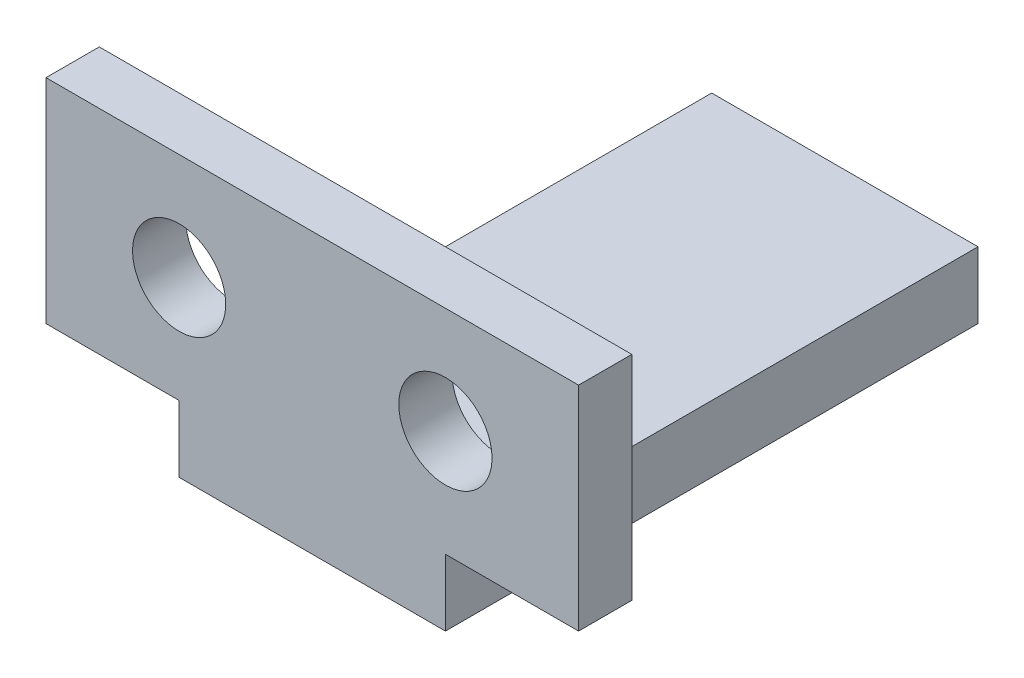
ISO-10303-21;
HEADER;
FILE_DESCRIPTION(('STEP AP214'),'2;1');
FILE_NAME('part.step','',(''),(''),'','','');
FILE_SCHEMA(('AUTOMOTIVE_DESIGN { 1 0 10303 214 1 1 1 1 }'));
ENDSEC;
DATA;
#1=APPLICATION_CONTEXT('core data for automotive mechanical design processes');
#2=APPLICATION_PROTOCOL_DEFINITION('international standard','automotive_design',2000,#1);
#3=PRODUCT_CONTEXT('',#1,'mechanical');
#4=PRODUCT('Part','Part','',(#3));
#5=PRODUCT_RELATED_PRODUCT_CATEGORY('part','',(#4));
#6=PRODUCT_DEFINITION_FORMATION('','',#4);
#7=PRODUCT_DEFINITION_CONTEXT('part definition',#1,'design');
#8=PRODUCT_DEFINITION('design','',#6,#7);
#9=PRODUCT_DEFINITION_SHAPE('','',#8);
#10=(LENGTH_UNIT() NAMED_UNIT(*) SI_UNIT(.MILLI.,.METRE.));
#11=(NAMED_UNIT(*) PLANE_ANGLE_UNIT() SI_UNIT($,.RADIAN.));
#12=(NAMED_UNIT(*) SI_UNIT($,.STERADIAN.) SOLID_ANGLE_UNIT());
#13=UNCERTAINTY_MEASURE_WITH_UNIT(LENGTH_MEASURE(1.E-05),#10,'distance_accuracy_value','');
#14=(GEOMETRIC_REPRESENTATION_CONTEXT(3) GLOBAL_UNCERTAINTY_ASSIGNED_CONTEXT((#13)) GLOBAL_UNIT_ASSIGNED_CONTEXT((#10,
#11,#12)) REPRESENTATION_CONTEXT('',''));
#15=CARTESIAN_POINT('',(0.,0.,0.));
#16=DIRECTION('',(0.,0.,1.));
#17=DIRECTION('',(1.,0.,0.));
#18=AXIS2_PLACEMENT_3D('',#15,#16,#17);
#19=CARTESIAN_POINT('',(0.,0.,2.));
#20=DIRECTION('',(0.,1.,0.));
#21=DIRECTION('',(0.,0.,1.));
#22=AXIS2_PLACEMENT_3D('',#19,#20,#21);
#23=PLANE('',#22);
#24=DIRECTION('',(0.,0.,1.));
#25=VECTOR('',#24,1.);
#26=CARTESIAN_POINT('',(15.,0.,-18.));
#27=LINE('',#26,#25);
#28=CARTESIAN_POINT('',(15.,0.,0.));
#29=VERTEX_POINT('',#28);
#30=CARTESIAN_POINT('',(15.,0.,2.));
#31=VERTEX_POINT('',#30);
#32=EDGE_CURVE('E11',#29,#31,#27,.T.);
#33=ORIENTED_EDGE('',*,*,#32,.F.);
#34=DIRECTION('',(1.,0.,0.));
#35=VECTOR('',#34,1.);
#36=CARTESIAN_POINT('',(0.,0.,0.));
#37=LINE('',#36,#35);
#38=CARTESIAN_POINT('',(20.,0.,0.));
#39=VERTEX_POINT('',#38);
#40=EDGE_CURVE('E167',#29,#39,#37,.T.);
#41=ORIENTED_EDGE('',*,*,#40,.T.);
#42=DIRECTION('',(0.,0.,-1.));
#43=VECTOR('',#42,1.);
#44=CARTESIAN_POINT('',(20.,0.,2.));
#45=LINE('',#44,#43);
#46=CARTESIAN_POINT('',(20.,0.,2.));
#47=VERTEX_POINT('',#46);
#48=EDGE_CURVE('E177',#47,#39,#45,.T.);
#49=ORIENTED_EDGE('',*,*,#48,.F.);
#50=DIRECTION('',(1.,0.,0.));
#51=VECTOR('',#50,1.);
#52=CARTESIAN_POINT('',(0.,0.,2.));
#53=LINE('',#52,#51);
#54=EDGE_CURVE('E159',#31,#47,#53,.T.);
#55=ORIENTED_EDGE('',*,*,#54,.F.);
#56=EDGE_LOOP('',(#33,#41,#49,#55));
#57=FACE_BOUND('',#56,.T.);
#58=ADVANCED_FACE('F35',(#57),#23,.F.);
#59=CARTESIAN_POINT('',(0.,0.,2.));
#60=DIRECTION('',(1.,0.,0.));
#61=DIRECTION('',(0.,0.,-1.));
#62=AXIS2_PLACEMENT_3D('',#59,#60,#61);
#63=PLANE('',#62);
#64=DIRECTION('',(0.,-1.,0.));
#65=VECTOR('',#64,1.);
#66=CARTESIAN_POINT('',(0.,0.,0.));
#67=LINE('',#66,#65);
#68=CARTESIAN_POINT('',(0.,8.,0.));
#69=VERTEX_POINT('',#68);
#70=CARTESIAN_POINT('',(0.,0.,0.));
#71=VERTEX_POINT('',#70);
#72=EDGE_CURVE('E153',#69,#71,#67,.T.);
#73=ORIENTED_EDGE('',*,*,#72,.T.);
#74=DIRECTION('',(0.,0.,-1.));
#75=VECTOR('',#74,1.);
#76=CARTESIAN_POINT('',(0.,0.,2.));
#77=LINE('',#76,#75);
#78=CARTESIAN_POINT('',(0.,0.,2.));
#79=VERTEX_POINT('',#78);
#80=EDGE_CURVE('E39',#79,#71,#77,.T.);
#81=ORIENTED_EDGE('',*,*,#80,.F.);
#82=DIRECTION('',(0.,-1.,0.));
#83=VECTOR('',#82,1.);
#84=CARTESIAN_POINT('',(0.,0.,2.));
#85=LINE('',#84,#83);
#86=CARTESIAN_POINT('',(0.,8.,2.));
#87=VERTEX_POINT('',#86);
#88=EDGE_CURVE('E157',#87,#79,#85,.T.);
#89=ORIENTED_EDGE('',*,*,#88,.F.);
#90=DIRECTION('',(0.,0.,-1.));
#91=VECTOR('',#90,1.);
#92=CARTESIAN_POINT('',(0.,8.,2.));
#93=LINE('',#92,#91);
#94=EDGE_CURVE('E164',#87,#69,#93,.T.);
#95=ORIENTED_EDGE('',*,*,#94,.T.);
#96=EDGE_LOOP('',(#73,#81,#89,#95));
#97=FACE_BOUND('',#96,.T.);
#98=ADVANCED_FACE('F37',(#97),#63,.F.);
#99=CARTESIAN_POINT('',(5.,0.,0.));
#100=VERTEX_POINT('',#99);
#101=EDGE_CURVE('E168',#71,#100,#37,.T.);
#102=ORIENTED_EDGE('',*,*,#101,.T.);
#103=DIRECTION('',(0.,0.,1.));
#104=VECTOR('',#103,1.);
#105=CARTESIAN_POINT('',(5.,0.,-18.));
#106=LINE('',#105,#104);
#107=CARTESIAN_POINT('',(5.,0.,2.));
#108=VERTEX_POINT('',#107);
#109=EDGE_CURVE('E44',#100,#108,#106,.T.);
#110=ORIENTED_EDGE('',*,*,#109,.T.);
#111=EDGE_CURVE('E90',#79,#108,#53,.T.);
#112=ORIENTED_EDGE('',*,*,#111,.F.);
#113=ORIENTED_EDGE('',*,*,#80,.T.);
#114=EDGE_LOOP('',(#102,#110,#112,#113));
#115=FACE_BOUND('',#114,.T.);
#116=ADVANCED_FACE('F184',(#115),#23,.F.);
#117=CARTESIAN_POINT('',(20.,0.,2.));
#118=DIRECTION('',(-1.,0.,0.));
#119=DIRECTION('',(0.,0.,1.));
#120=AXIS2_PLACEMENT_3D('',#117,#118,#119);
#121=PLANE('',#120);
#122=DIRECTION('',(0.,1.,0.));
#123=VECTOR('',#122,1.);
#124=CARTESIAN_POINT('',(20.,0.,0.));
#125=LINE('',#124,#123);
#126=CARTESIAN_POINT('',(20.,8.,0.));
#127=VERTEX_POINT('',#126);
#128=EDGE_CURVE('E171',#39,#127,#125,.T.);
#129=ORIENTED_EDGE('',*,*,#128,.T.);
#130=DIRECTION('',(0.,0.,-1.));
#131=VECTOR('',#130,1.);
#132=CARTESIAN_POINT('',(20.,8.,2.));
#133=LINE('',#132,#131);
#134=CARTESIAN_POINT('',(20.,8.,2.));
#135=VERTEX_POINT('',#134);
#136=EDGE_CURVE('E176',#135,#127,#133,.T.);
#137=ORIENTED_EDGE('',*,*,#136,.F.);
#138=DIRECTION('',(0.,1.,0.));
#139=VECTOR('',#138,1.);
#140=CARTESIAN_POINT('',(20.,0.,2.));
#141=LINE('',#140,#139);
#142=EDGE_CURVE('E161',#47,#135,#141,.T.);
#143=ORIENTED_EDGE('',*,*,#142,.F.);
#144=ORIENTED_EDGE('',*,*,#48,.T.);
#145=EDGE_LOOP('',(#129,#137,#143,#144));
#146=FACE_BOUND('',#145,.T.);
#147=ADVANCED_FACE('F201',(#146),#121,.F.);
#148=CARTESIAN_POINT('',(0.,8.,2.));
#149=DIRECTION('',(0.,-1.,0.));
#150=DIRECTION('',(0.,0.,-1.));
#151=AXIS2_PLACEMENT_3D('',#148,#149,#150);
#152=PLANE('',#151);
#153=DIRECTION('',(-1.,0.,0.));
#154=VECTOR('',#153,1.);
#155=CARTESIAN_POINT('',(0.,8.,0.));
#156=LINE('',#155,#154);
#157=EDGE_CURVE('E83',#127,#69,#156,.T.);
#158=ORIENTED_EDGE('',*,*,#157,.T.);
#159=ORIENTED_EDGE('',*,*,#94,.F.);
#160=DIRECTION('',(-1.,0.,0.));
#161=VECTOR('',#160,1.);
#162=CARTESIAN_POINT('',(0.,8.,2.));
#163=LINE('',#162,#161);
#164=EDGE_CURVE('E62',#135,#87,#163,.T.);
#165=ORIENTED_EDGE('',*,*,#164,.F.);
#166=ORIENTED_EDGE('',*,*,#136,.T.);
#167=EDGE_LOOP('',(#158,#159,#165,#166));
#168=FACE_BOUND('',#167,.T.);
#169=ADVANCED_FACE('F202',(#168),#152,.F.);
#170=CARTESIAN_POINT('',(0.,0.,2.));
#171=DIRECTION('',(0.,0.,-1.));
#172=DIRECTION('',(-1.,0.,0.));
#173=AXIS2_PLACEMENT_3D('',#170,#171,#172);
#174=PLANE('',#173);
#175=CARTESIAN_POINT('',(5.,4.,2.));
#176=DIRECTION('',(0.,0.,-1.));
#177=DIRECTION('',(-1.,0.,0.));
#178=AXIS2_PLACEMENT_3D('',#175,#176,#177);
#179=CIRCLE('',#178,1.75);
#180=CARTESIAN_POINT('',(3.25,4.,2.));
#181=VERTEX_POINT('',#180);
#182=EDGE_CURVE('E325',#181,#181,#179,.T.);
#183=ORIENTED_EDGE('',*,*,#182,.T.);
#184=EDGE_LOOP('',(#183));
#185=FACE_BOUND('',#184,.T.);
#186=CARTESIAN_POINT('',(15.,4.,2.));
#187=DIRECTION('',(0.,0.,-1.));
#188=DIRECTION('',(-1.,0.,0.));
#189=AXIS2_PLACEMENT_3D('',#186,#187,#188);
#190=CIRCLE('',#189,1.75);
#191=CARTESIAN_POINT('',(13.25,4.,2.));
#192=VERTEX_POINT('',#191);
#193=EDGE_CURVE('E146',#192,#192,#190,.T.);
#194=ORIENTED_EDGE('',*,*,#193,.T.);
#195=EDGE_LOOP('',(#194));
#196=FACE_BOUND('',#195,.T.);
#197=ORIENTED_EDGE('',*,*,#88,.T.);
#198=ORIENTED_EDGE('',*,*,#111,.T.);
#199=DIRECTION('',(0.,-1.,0.));
#200=VECTOR('',#199,1.);
#201=CARTESIAN_POINT('',(5.,0.,2.));
#202=LINE('',#201,#200);
#203=CARTESIAN_POINT('',(5.,-2.5,2.));
#204=VERTEX_POINT('',#203);
#205=EDGE_CURVE('E53',#108,#204,#202,.T.);
#206=ORIENTED_EDGE('',*,*,#205,.T.);
#207=DIRECTION('',(1.,0.,0.));
#208=VECTOR('',#207,1.);
#209=CARTESIAN_POINT('',(5.,-2.5,2.));
#210=LINE('',#209,#208);
#211=CARTESIAN_POINT('',(15.,-2.5,2.));
#212=VERTEX_POINT('',#211);
#213=EDGE_CURVE('E123',#204,#212,#210,.T.);
#214=ORIENTED_EDGE('',*,*,#213,.T.);
#215=DIRECTION('',(0.,1.,0.));
#216=VECTOR('',#215,1.);
#217=CARTESIAN_POINT('',(15.,0.,2.));
#218=LINE('',#217,#216);
#219=EDGE_CURVE('E141',#212,#31,#218,.T.);
#220=ORIENTED_EDGE('',*,*,#219,.T.);
#221=ORIENTED_EDGE('',*,*,#54,.T.);
#222=ORIENTED_EDGE('',*,*,#142,.T.);
#223=ORIENTED_EDGE('',*,*,#164,.T.);
#224=EDGE_LOOP('',(#197,#198,#206,#214,#220,#221,#222,#223));
#225=FACE_BOUND('',#224,.T.);
#226=ADVANCED_FACE('F185',(#185,#196,#225),#174,.F.);
#227=CARTESIAN_POINT('',(0.,0.,0.));
#228=DIRECTION('',(0.,0.,-1.));
#229=DIRECTION('',(-1.,0.,0.));
#230=AXIS2_PLACEMENT_3D('',#227,#228,#229);
#231=PLANE('',#230);
#232=CARTESIAN_POINT('',(5.,4.,0.));
#233=DIRECTION('',(0.,0.,-1.));
#234=DIRECTION('',(1.,0.,0.));
#235=AXIS2_PLACEMENT_3D('',#232,#233,#234);
#236=CIRCLE('',#235,1.75);
#237=CARTESIAN_POINT('',(6.75,4.,0.));
#238=VERTEX_POINT('',#237);
#239=EDGE_CURVE('E321',#238,#238,#236,.T.);
#240=ORIENTED_EDGE('',*,*,#239,.F.);
#241=EDGE_LOOP('',(#240));
#242=FACE_BOUND('',#241,.T.);
#243=CARTESIAN_POINT('',(15.,4.,0.));
#244=DIRECTION('',(0.,0.,-1.));
#245=DIRECTION('',(-1.,0.,0.));
#246=AXIS2_PLACEMENT_3D('',#243,#244,#245);
#247=CIRCLE('',#246,1.75);
#248=CARTESIAN_POINT('',(13.25,4.,0.));
#249=VERTEX_POINT('',#248);
#250=EDGE_CURVE('E324',#249,#249,#247,.T.);
#251=ORIENTED_EDGE('',*,*,#250,.F.);
#252=EDGE_LOOP('',(#251));
#253=FACE_BOUND('',#252,.T.);
#254=ORIENTED_EDGE('',*,*,#72,.F.);
#255=ORIENTED_EDGE('',*,*,#157,.F.);
#256=ORIENTED_EDGE('',*,*,#128,.F.);
#257=ORIENTED_EDGE('',*,*,#40,.F.);
#258=EDGE_CURVE('E172',#100,#29,#37,.T.);
#259=ORIENTED_EDGE('',*,*,#258,.F.);
#260=ORIENTED_EDGE('',*,*,#101,.F.);
#261=EDGE_LOOP('',(#254,#255,#256,#257,#259,#260));
#262=FACE_BOUND('',#261,.T.);
#263=ADVANCED_FACE('F190',(#242,#253,#262),#231,.T.);
#264=CARTESIAN_POINT('',(5.,0.,-18.));
#265=DIRECTION('',(-1.,0.,0.));
#266=DIRECTION('',(0.,-1.,0.));
#267=AXIS2_PLACEMENT_3D('',#264,#265,#266);
#268=PLANE('',#267);
#269=ORIENTED_EDGE('',*,*,#205,.F.);
#270=ORIENTED_EDGE('',*,*,#109,.F.);
#271=CARTESIAN_POINT('',(5.,0.,-18.));
#272=VERTEX_POINT('',#271);
#273=EDGE_CURVE('E140',#272,#100,#106,.T.);
#274=ORIENTED_EDGE('',*,*,#273,.F.);
#275=DIRECTION('',(0.,-1.,0.));
#276=VECTOR('',#275,1.);
#277=CARTESIAN_POINT('',(5.,0.,-18.));
#278=LINE('',#277,#276);
#279=CARTESIAN_POINT('',(5.,-2.5,-18.));
#280=VERTEX_POINT('',#279);
#281=EDGE_CURVE('E133',#272,#280,#278,.T.);
#282=ORIENTED_EDGE('',*,*,#281,.T.);
#283=DIRECTION('',(0.,0.,1.));
#284=VECTOR('',#283,1.);
#285=CARTESIAN_POINT('',(5.,-2.5,-18.));
#286=LINE('',#285,#284);
#287=EDGE_CURVE('E118',#280,#204,#286,.T.);
#288=ORIENTED_EDGE('',*,*,#287,.T.);
#289=EDGE_LOOP('',(#269,#270,#274,#282,#288));
#290=FACE_BOUND('',#289,.T.);
#291=ADVANCED_FACE('F138',(#290),#268,.T.);
#292=CARTESIAN_POINT('',(5.,0.,-18.));
#293=DIRECTION('',(0.,1.,0.));
#294=DIRECTION('',(-1.,0.,0.));
#295=AXIS2_PLACEMENT_3D('',#292,#293,#294);
#296=PLANE('',#295);
#297=ORIENTED_EDGE('',*,*,#273,.T.);
#298=ORIENTED_EDGE('',*,*,#258,.T.);
#299=CARTESIAN_POINT('',(15.,0.,-18.));
#300=VERTEX_POINT('',#299);
#301=EDGE_CURVE('E46',#300,#29,#27,.T.);
#302=ORIENTED_EDGE('',*,*,#301,.F.);
#303=DIRECTION('',(-1.,0.,0.));
#304=VECTOR('',#303,1.);
#305=CARTESIAN_POINT('',(5.,0.,-18.));
#306=LINE('',#305,#304);
#307=EDGE_CURVE('E126',#300,#272,#306,.T.);
#308=ORIENTED_EDGE('',*,*,#307,.T.);
#309=EDGE_LOOP('',(#297,#298,#302,#308));
#310=FACE_BOUND('',#309,.T.);
#311=ADVANCED_FACE('F259',(#310),#296,.T.);
#312=CARTESIAN_POINT('',(15.,0.,-18.));
#313=DIRECTION('',(1.,0.,0.));
#314=DIRECTION('',(0.,1.,0.));
#315=AXIS2_PLACEMENT_3D('',#312,#313,#314);
#316=PLANE('',#315);
#317=ORIENTED_EDGE('',*,*,#219,.F.);
#318=DIRECTION('',(0.,0.,1.));
#319=VECTOR('',#318,1.);
#320=CARTESIAN_POINT('',(15.,-2.5,-18.));
#321=LINE('',#320,#319);
#322=CARTESIAN_POINT('',(15.,-2.5,-18.));
#323=VERTEX_POINT('',#322);
#324=EDGE_CURVE('E125',#323,#212,#321,.T.);
#325=ORIENTED_EDGE('',*,*,#324,.F.);
#326=DIRECTION('',(0.,1.,0.));
#327=VECTOR('',#326,1.);
#328=CARTESIAN_POINT('',(15.,0.,-18.));
#329=LINE('',#328,#327);
#330=EDGE_CURVE('E136',#323,#300,#329,.T.);
#331=ORIENTED_EDGE('',*,*,#330,.T.);
#332=ORIENTED_EDGE('',*,*,#301,.T.);
#333=ORIENTED_EDGE('',*,*,#32,.T.);
#334=EDGE_LOOP('',(#317,#325,#331,#332,#333));
#335=FACE_BOUND('',#334,.T.);
#336=ADVANCED_FACE('F199',(#335),#316,.T.);
#337=CARTESIAN_POINT('',(5.,-2.5,-18.));
#338=DIRECTION('',(0.,-1.,0.));
#339=DIRECTION('',(1.,0.,0.));
#340=AXIS2_PLACEMENT_3D('',#337,#338,#339);
#341=PLANE('',#340);
#342=ORIENTED_EDGE('',*,*,#213,.F.);
#343=ORIENTED_EDGE('',*,*,#287,.F.);
#344=DIRECTION('',(1.,0.,0.));
#345=VECTOR('',#344,1.);
#346=CARTESIAN_POINT('',(5.,-2.5,-18.));
#347=LINE('',#346,#345);
#348=EDGE_CURVE('E121',#280,#323,#347,.T.);
#349=ORIENTED_EDGE('',*,*,#348,.T.);
#350=ORIENTED_EDGE('',*,*,#324,.T.);
#351=EDGE_LOOP('',(#342,#343,#349,#350));
#352=FACE_BOUND('',#351,.T.);
#353=ADVANCED_FACE('F120',(#352),#341,.T.);
#354=CARTESIAN_POINT('',(0.,0.,-18.));
#355=DIRECTION('',(0.,0.,1.));
#356=DIRECTION('',(1.,0.,0.));
#357=AXIS2_PLACEMENT_3D('',#354,#355,#356);
#358=PLANE('',#357);
#359=ORIENTED_EDGE('',*,*,#281,.F.);
#360=ORIENTED_EDGE('',*,*,#307,.F.);
#361=ORIENTED_EDGE('',*,*,#330,.F.);
#362=ORIENTED_EDGE('',*,*,#348,.F.);
#363=EDGE_LOOP('',(#359,#360,#361,#362));
#364=FACE_BOUND('',#363,.T.);
#365=ADVANCED_FACE('F131',(#364),#358,.F.);
#366=CARTESIAN_POINT('',(15.,4.,20.));
#367=DIRECTION('',(0.,0.,-1.));
#368=DIRECTION('',(-1.,0.,0.));
#369=AXIS2_PLACEMENT_3D('',#366,#367,#368);
#370=CYLINDRICAL_SURFACE('',#369,1.75);
#371=ORIENTED_EDGE('',*,*,#250,.T.);
#372=EDGE_LOOP('',(#371));
#373=FACE_BOUND('',#372,.T.);
#374=ORIENTED_EDGE('',*,*,#193,.F.);
#375=EDGE_LOOP('',(#374));
#376=FACE_BOUND('',#375,.T.);
#377=ADVANCED_FACE('F287',(#373,#376),#370,.F.);
#378=CARTESIAN_POINT('',(5.,4.,20.));
#379=DIRECTION('',(0.,0.,-1.));
#380=DIRECTION('',(-1.,0.,0.));
#381=AXIS2_PLACEMENT_3D('',#378,#379,#380);
#382=CYLINDRICAL_SURFACE('',#381,1.75);
#383=ORIENTED_EDGE('',*,*,#239,.T.);
#384=EDGE_LOOP('',(#383));
#385=FACE_BOUND('',#384,.T.);
#386=ORIENTED_EDGE('',*,*,#182,.F.);
#387=EDGE_LOOP('',(#386));
#388=FACE_BOUND('',#387,.T.);
#389=ADVANCED_FACE('F295',(#385,#388),#382,.F.);
#390=CLOSED_SHELL('',(#58,#98,#116,#147,#169,#226,#263,#291,#311,#336,#353,#365,#377,#389));
#391=MANIFOLD_SOLID_BREP('B2',#390);
#392=ADVANCED_BREP_SHAPE_REPRESENTATION('',(#18,#391),#14);
#393=SHAPE_DEFINITION_REPRESENTATION(#9,#392);
ENDSEC;
END-ISO-10303-21;
